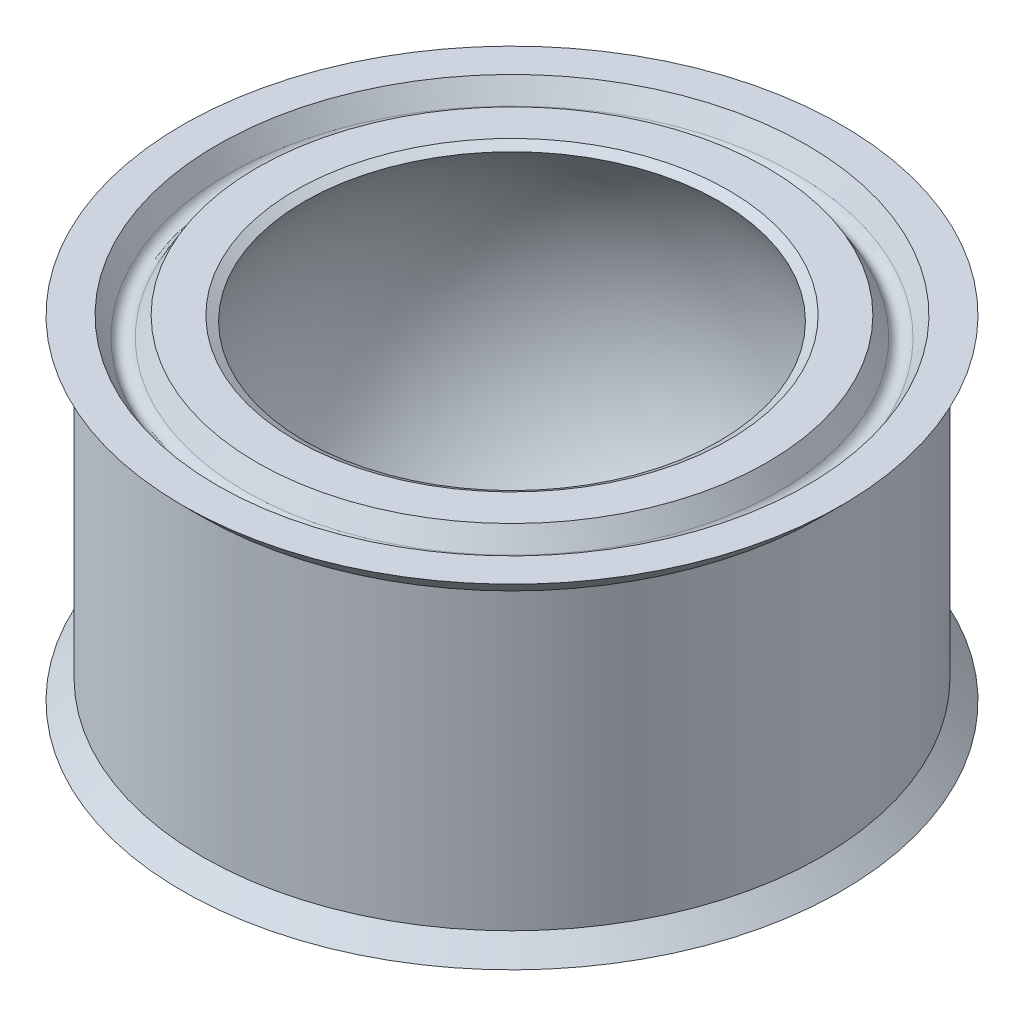
ISO-10303-21;
HEADER;
FILE_DESCRIPTION(('STEP AP214'),'2;1');
FILE_NAME('part.step','',(''),(''),'','','');
FILE_SCHEMA(('AUTOMOTIVE_DESIGN { 1 0 10303 214 1 1 1 1 }'));
ENDSEC;
DATA;
#1=APPLICATION_CONTEXT('core data for automotive mechanical design processes');
#2=APPLICATION_PROTOCOL_DEFINITION('international standard','automotive_design',2000,#1);
#3=PRODUCT_CONTEXT('',#1,'mechanical');
#4=PRODUCT('Part','Part','',(#3));
#5=PRODUCT_RELATED_PRODUCT_CATEGORY('part','',(#4));
#6=PRODUCT_DEFINITION_FORMATION('','',#4);
#7=PRODUCT_DEFINITION_CONTEXT('part definition',#1,'design');
#8=PRODUCT_DEFINITION('design','',#6,#7);
#9=PRODUCT_DEFINITION_SHAPE('','',#8);
#10=(LENGTH_UNIT() NAMED_UNIT(*) SI_UNIT(.MILLI.,.METRE.));
#11=(NAMED_UNIT(*) PLANE_ANGLE_UNIT() SI_UNIT($,.RADIAN.));
#12=(NAMED_UNIT(*) SI_UNIT($,.STERADIAN.) SOLID_ANGLE_UNIT());
#13=UNCERTAINTY_MEASURE_WITH_UNIT(LENGTH_MEASURE(1.E-05),#10,'distance_accuracy_value','');
#14=(GEOMETRIC_REPRESENTATION_CONTEXT(3) GLOBAL_UNCERTAINTY_ASSIGNED_CONTEXT((#13)) GLOBAL_UNIT_ASSIGNED_CONTEXT((#10,
#11,#12)) REPRESENTATION_CONTEXT('',''));
#15=CARTESIAN_POINT('',(0.,0.,0.));
#16=DIRECTION('',(0.,0.,1.));
#17=DIRECTION('',(1.,0.,0.));
#18=AXIS2_PLACEMENT_3D('',#15,#16,#17);
#19=CARTESIAN_POINT('',(0.,0.,39.6748));
#20=DIRECTION('',(0.,-1.,0.));
#21=DIRECTION('',(1.,0.,0.));
#22=AXIS2_PLACEMENT_3D('',#19,#20,#21);
#23=DEGENERATE_TOROIDAL_SURFACE('',#22,0.0076200000000071,6.73781301182615,.T.);
#24=CARTESIAN_POINT('',(0.,-4.14684588560021,39.6748));
#25=DIRECTION('',(0.,-1.,0.));
#26=DIRECTION('',(1.,0.,0.));
#27=AXIS2_PLACEMENT_3D('',#24,#25,#26);
#28=CIRCLE('',#27,5.31815607314457);
#29=CARTESIAN_POINT('',(-5.31815607312949,-4.14684588561096,39.6748));
#30=VERTEX_POINT('',#29);
#31=CARTESIAN_POINT('',(5.31815607312949,-4.14684588559675,39.6748));
#32=VERTEX_POINT('',#31);
#33=EDGE_CURVE('E46',#30,#32,#28,.T.);
#34=ORIENTED_EDGE('',*,*,#33,.T.);
#35=CARTESIAN_POINT('',(0.,-4.14684588560021,39.6748));
#36=DIRECTION('',(0.,-1.,0.));
#37=DIRECTION('',(1.,0.,0.));
#38=AXIS2_PLACEMENT_3D('',#35,#36,#37);
#39=CIRCLE('',#38,5.31815607314457);
#40=EDGE_CURVE('E42',#32,#30,#39,.T.);
#41=ORIENTED_EDGE('',*,*,#40,.T.);
#42=EDGE_LOOP('',(#34,#41));
#43=FACE_BOUND('',#42,.T.);
#44=CARTESIAN_POINT('',(0.,4.14684588560022,39.6748));
#45=DIRECTION('',(0.,1.,0.));
#46=DIRECTION('',(1.,0.,0.));
#47=AXIS2_PLACEMENT_3D('',#44,#45,#46);
#48=CIRCLE('',#47,5.31815607308772);
#49=CARTESIAN_POINT('',(5.31815607308772,4.14684588560021,39.6748));
#50=VERTEX_POINT('',#49);
#51=EDGE_CURVE('E56',#50,#50,#48,.T.);
#52=ORIENTED_EDGE('',*,*,#51,.T.);
#53=EDGE_LOOP('',(#52));
#54=FACE_BOUND('',#53,.T.);
#55=ADVANCED_FACE('F16',(#43,#54),#23,.F.);
#56=CARTESIAN_POINT('',(0.,-4.27989999991496,39.6748));
#57=DIRECTION('',(0.,-1.,0.));
#58=DIRECTION('',(1.,0.,0.));
#59=AXIS2_PLACEMENT_3D('',#56,#57,#58);
#60=CONICAL_SURFACE('',#59,5.54870547671271,1.04737208418554);
#61=CARTESIAN_POINT('',(0.,-4.27989999988215,39.6748));
#62=DIRECTION('',(0.,-1.,0.));
#63=DIRECTION('',(1.,0.,0.));
#64=AXIS2_PLACEMENT_3D('',#61,#62,#63);
#65=CIRCLE('',#64,5.54870547665587);
#66=CARTESIAN_POINT('',(-5.54870547665587,-4.27989999992698,39.6748));
#67=VERTEX_POINT('',#66);
#68=CARTESIAN_POINT('',(5.54870547659902,-4.27989999988215,39.6748));
#69=VERTEX_POINT('',#68);
#70=EDGE_CURVE('E19',#67,#69,#65,.F.);
#71=ORIENTED_EDGE('',*,*,#70,.F.);
#72=DIRECTION('',(0.866112657056276,0.49984884243831,0.));
#73=VECTOR('',#72,1.);
#74=CARTESIAN_POINT('',(-499000.,-287982.751096156,39.6748000000258));
#75=LINE('',#74,#73);
#76=EDGE_CURVE('E47',#67,#30,#75,.T.);
#77=ORIENTED_EDGE('',*,*,#76,.T.);
#78=ORIENTED_EDGE('',*,*,#40,.F.);
#79=DIRECTION('',(-0.866112657056275,0.49984884243831,0.));
#80=VECTOR('',#79,1.);
#81=CARTESIAN_POINT('',(499000.,-287982.751096157,39.6748));
#82=LINE('',#81,#80);
#83=EDGE_CURVE('E32',#32,#69,#82,.F.);
#84=ORIENTED_EDGE('',*,*,#83,.T.);
#85=EDGE_LOOP('',(#71,#77,#78,#84));
#86=FACE_BOUND('',#85,.T.);
#87=ADVANCED_FACE('F50',(#86),#60,.F.);
#88=CARTESIAN_POINT('',(0.,-4.2798999999718,39.6748));
#89=DIRECTION('',(0.,-1.,0.));
#90=DIRECTION('',(1.,0.,0.));
#91=AXIS2_PLACEMENT_3D('',#88,#89,#90);
#92=CONICAL_SURFACE('',#91,5.54870547676956,1.04737208410733);
#93=ORIENTED_EDGE('',*,*,#33,.F.);
#94=ORIENTED_EDGE('',*,*,#76,.F.);
#95=CARTESIAN_POINT('',(0.,-4.279899999939,39.6748));
#96=DIRECTION('',(0.,-1.,0.));
#97=DIRECTION('',(1.,0.,0.));
#98=AXIS2_PLACEMENT_3D('',#95,#96,#97);
#99=CIRCLE('',#98,5.54870547671271);
#100=EDGE_CURVE('E85',#69,#67,#99,.F.);
#101=ORIENTED_EDGE('',*,*,#100,.F.);
#102=ORIENTED_EDGE('',*,*,#83,.F.);
#103=EDGE_LOOP('',(#93,#94,#101,#102));
#104=FACE_BOUND('',#103,.T.);
#105=ADVANCED_FACE('F54',(#104),#92,.F.);
#106=CARTESIAN_POINT('',(0.,4.2798999999718,39.6748));
#107=DIRECTION('',(0.,1.,0.));
#108=DIRECTION('',(0.,0.,1.));
#109=AXIS2_PLACEMENT_3D('',#106,#107,#108);
#110=CONICAL_SURFACE('',#109,5.54870547676956,1.04737208421407);
#111=CARTESIAN_POINT('',(0.,4.2798999999718,39.6748));
#112=DIRECTION('',(0.,1.,0.));
#113=DIRECTION('',(0.,0.,1.));
#114=AXIS2_PLACEMENT_3D('',#111,#112,#113);
#115=CIRCLE('',#114,5.54870547676956);
#116=CARTESIAN_POINT('',(0.,4.2798999999718,45.2235054767696));
#117=VERTEX_POINT('',#116);
#118=EDGE_CURVE('E83',#117,#117,#115,.F.);
#119=ORIENTED_EDGE('',*,*,#118,.F.);
#120=EDGE_LOOP('',(#119));
#121=FACE_BOUND('',#120,.T.);
#122=ORIENTED_EDGE('',*,*,#51,.F.);
#123=EDGE_LOOP('',(#122));
#124=FACE_BOUND('',#123,.T.);
#125=ADVANCED_FACE('F127',(#121,#124),#110,.F.);
#126=CARTESIAN_POINT('',(0.,-4.2799,39.6748));
#127=DIRECTION('',(0.,-1.,0.));
#128=DIRECTION('',(0.,0.,-1.));
#129=AXIS2_PLACEMENT_3D('',#126,#127,#128);
#130=PLANE('',#129);
#131=CARTESIAN_POINT('',(0.,-4.27990000002865,39.6748));
#132=DIRECTION('',(0.,1.,0.));
#133=DIRECTION('',(0.,0.,1.));
#134=AXIS2_PLACEMENT_3D('',#131,#132,#133);
#135=CIRCLE('',#134,6.54049999999568);
#136=CARTESIAN_POINT('',(0.,-4.27990000002865,46.2152999999957));
#137=VERTEX_POINT('',#136);
#138=EDGE_CURVE('E80',#137,#137,#135,.T.);
#139=ORIENTED_EDGE('',*,*,#138,.F.);
#140=EDGE_LOOP('',(#139));
#141=FACE_BOUND('',#140,.T.);
#142=ORIENTED_EDGE('',*,*,#70,.T.);
#143=ORIENTED_EDGE('',*,*,#100,.T.);
#144=EDGE_LOOP('',(#142,#143));
#145=FACE_BOUND('',#144,.T.);
#146=ADVANCED_FACE('F123',(#141,#145),#130,.T.);
#147=CARTESIAN_POINT('',(0.,4.2799,39.6748));
#148=DIRECTION('',(0.,1.,0.));
#149=DIRECTION('',(0.,0.,1.));
#150=AXIS2_PLACEMENT_3D('',#147,#148,#149);
#151=PLANE('',#150);
#152=CARTESIAN_POINT('',(0.,4.27990000002865,39.6748));
#153=DIRECTION('',(0.,-1.,0.));
#154=DIRECTION('',(0.,0.,-1.));
#155=AXIS2_PLACEMENT_3D('',#152,#153,#154);
#156=CIRCLE('',#155,6.54049999999568);
#157=CARTESIAN_POINT('',(0.,4.27990000002865,33.1343000000043));
#158=VERTEX_POINT('',#157);
#159=EDGE_CURVE('E76',#158,#158,#156,.T.);
#160=ORIENTED_EDGE('',*,*,#159,.F.);
#161=EDGE_LOOP('',(#160));
#162=FACE_BOUND('',#161,.T.);
#163=ORIENTED_EDGE('',*,*,#118,.T.);
#164=EDGE_LOOP('',(#163));
#165=FACE_BOUND('',#164,.T.);
#166=ADVANCED_FACE('F119',(#162,#165),#151,.T.);
#167=CARTESIAN_POINT('',(0.,-3.7810188050571,39.6748));
#168=DIRECTION('',(0.,1.,0.));
#169=DIRECTION('',(0.,0.,1.));
#170=AXIS2_PLACEMENT_3D('',#167,#168,#169);
#171=CONICAL_SURFACE('',#170,6.82852919220546,0.523598775597274);
#172=CARTESIAN_POINT('',(0.,-3.78101880512248,39.6748));
#173=DIRECTION('',(0.,-1.,0.));
#174=DIRECTION('',(0.,0.,-1.));
#175=AXIS2_PLACEMENT_3D('',#172,#173,#174);
#176=CIRCLE('',#175,6.82852919215618);
#177=CARTESIAN_POINT('',(0.,-3.78101880512248,32.8462708078438));
#178=VERTEX_POINT('',#177);
#179=EDGE_CURVE('E79',#178,#178,#176,.T.);
#180=ORIENTED_EDGE('',*,*,#179,.T.);
#181=EDGE_LOOP('',(#180));
#182=FACE_BOUND('',#181,.T.);
#183=ORIENTED_EDGE('',*,*,#138,.T.);
#184=EDGE_LOOP('',(#183));
#185=FACE_BOUND('',#184,.T.);
#186=ADVANCED_FACE('F115',(#182,#185),#171,.T.);
#187=CARTESIAN_POINT('',(0.,3.7810188050571,39.6748));
#188=DIRECTION('',(0.,-1.,0.));
#189=DIRECTION('',(0.,0.,-1.));
#190=AXIS2_PLACEMENT_3D('',#187,#188,#189);
#191=CONICAL_SURFACE('',#190,6.82852919220546,0.523598775597275);
#192=CARTESIAN_POINT('',(0.,3.78101880512248,39.6748));
#193=DIRECTION('',(0.,1.,0.));
#194=DIRECTION('',(0.,0.,-1.));
#195=AXIS2_PLACEMENT_3D('',#192,#193,#194);
#196=CIRCLE('',#195,6.82852919215618);
#197=CARTESIAN_POINT('',(0.,3.78101880512248,32.8462708078438));
#198=VERTEX_POINT('',#197);
#199=EDGE_CURVE('E97',#198,#198,#196,.T.);
#200=ORIENTED_EDGE('',*,*,#199,.T.);
#201=EDGE_LOOP('',(#200));
#202=FACE_BOUND('',#201,.T.);
#203=ORIENTED_EDGE('',*,*,#159,.T.);
#204=EDGE_LOOP('',(#203));
#205=FACE_BOUND('',#204,.T.);
#206=ADVANCED_FACE('F110',(#202,#205),#191,.T.);
#207=CARTESIAN_POINT('',(0.,-3.90801901024499,39.6748));
#208=DIRECTION('',(0.,-1.,0.));
#209=DIRECTION('',(0.,0.,-1.));
#210=AXIS2_PLACEMENT_3D('',#207,#208,#209);
#211=TOROIDAL_SURFACE('',#210,7.0485,0.254000410244989);
#212=ORIENTED_EDGE('',*,*,#179,.F.);
#213=EDGE_LOOP('',(#212));
#214=FACE_BOUND('',#213,.T.);
#215=CARTESIAN_POINT('',(0.,-3.78101880512248,39.6748));
#216=DIRECTION('',(0.,-1.,0.));
#217=DIRECTION('',(0.,0.,1.));
#218=AXIS2_PLACEMENT_3D('',#215,#216,#217);
#219=CIRCLE('',#218,7.26847080784382);
#220=CARTESIAN_POINT('',(0.,-3.78101880512248,46.9432708078438));
#221=VERTEX_POINT('',#220);
#222=EDGE_CURVE('E100',#221,#221,#219,.T.);
#223=ORIENTED_EDGE('',*,*,#222,.T.);
#224=EDGE_LOOP('',(#223));
#225=FACE_BOUND('',#224,.T.);
#226=ADVANCED_FACE('F105',(#214,#225),#211,.F.);
#227=CARTESIAN_POINT('',(0.,3.90801901024499,39.6748));
#228=DIRECTION('',(0.,1.,0.));
#229=DIRECTION('',(0.,0.,-1.));
#230=AXIS2_PLACEMENT_3D('',#227,#228,#229);
#231=TOROIDAL_SURFACE('',#230,7.0485,0.254000410244989);
#232=ORIENTED_EDGE('',*,*,#199,.F.);
#233=EDGE_LOOP('',(#232));
#234=FACE_BOUND('',#233,.T.);
#235=CARTESIAN_POINT('',(0.,3.78101880512248,39.6748));
#236=DIRECTION('',(0.,1.,0.));
#237=DIRECTION('',(0.,0.,1.));
#238=AXIS2_PLACEMENT_3D('',#235,#236,#237);
#239=CIRCLE('',#238,7.26847080784382);
#240=CARTESIAN_POINT('',(0.,3.78101880512248,46.9432708078438));
#241=VERTEX_POINT('',#240);
#242=EDGE_CURVE('E75',#241,#241,#239,.T.);
#243=ORIENTED_EDGE('',*,*,#242,.T.);
#244=EDGE_LOOP('',(#243));
#245=FACE_BOUND('',#244,.T.);
#246=ADVANCED_FACE('F109',(#234,#245),#231,.F.);
#247=CARTESIAN_POINT('',(0.,-4.2799,39.6748));
#248=DIRECTION('',(0.,-1.,0.));
#249=DIRECTION('',(0.,0.,-1.));
#250=AXIS2_PLACEMENT_3D('',#247,#248,#249);
#251=CONICAL_SURFACE('',#250,7.55649999999999,0.523598775598298);
#252=CARTESIAN_POINT('',(0.,-4.2799,39.6748));
#253=DIRECTION('',(0.,-1.,0.));
#254=DIRECTION('',(0.,0.,-1.));
#255=AXIS2_PLACEMENT_3D('',#252,#253,#254);
#256=CIRCLE('',#255,7.55649999999999);
#257=CARTESIAN_POINT('',(0.,-4.2799,32.1183));
#258=VERTEX_POINT('',#257);
#259=EDGE_CURVE('E72',#258,#258,#256,.F.);
#260=ORIENTED_EDGE('',*,*,#259,.F.);
#261=EDGE_LOOP('',(#260));
#262=FACE_BOUND('',#261,.T.);
#263=ORIENTED_EDGE('',*,*,#222,.F.);
#264=EDGE_LOOP('',(#263));
#265=FACE_BOUND('',#264,.T.);
#266=ADVANCED_FACE('F167',(#262,#265),#251,.F.);
#267=CARTESIAN_POINT('',(0.,4.2799,39.6748));
#268=DIRECTION('',(0.,1.,0.));
#269=DIRECTION('',(0.,0.,1.));
#270=AXIS2_PLACEMENT_3D('',#267,#268,#269);
#271=CONICAL_SURFACE('',#270,7.55649999999999,0.523598775598298);
#272=CARTESIAN_POINT('',(0.,4.2799,39.6748));
#273=DIRECTION('',(0.,1.,0.));
#274=DIRECTION('',(0.,0.,1.));
#275=AXIS2_PLACEMENT_3D('',#272,#273,#274);
#276=CIRCLE('',#275,7.55649999999999);
#277=CARTESIAN_POINT('',(0.,4.2799,47.2313));
#278=VERTEX_POINT('',#277);
#279=EDGE_CURVE('E69',#278,#278,#276,.F.);
#280=ORIENTED_EDGE('',*,*,#279,.F.);
#281=EDGE_LOOP('',(#280));
#282=FACE_BOUND('',#281,.T.);
#283=ORIENTED_EDGE('',*,*,#242,.F.);
#284=EDGE_LOOP('',(#283));
#285=FACE_BOUND('',#284,.T.);
#286=ADVANCED_FACE('F164',(#282,#285),#271,.F.);
#287=CARTESIAN_POINT('',(0.,-4.2799,39.6748));
#288=DIRECTION('',(0.,-1.,0.));
#289=DIRECTION('',(0.,0.,-1.));
#290=AXIS2_PLACEMENT_3D('',#287,#288,#289);
#291=PLANE('',#290);
#292=ORIENTED_EDGE('',*,*,#259,.T.);
#293=EDGE_LOOP('',(#292));
#294=FACE_BOUND('',#293,.T.);
#295=CARTESIAN_POINT('',(0.,-4.2799,39.6748));
#296=DIRECTION('',(0.,-1.,0.));
#297=DIRECTION('',(0.,0.,-1.));
#298=AXIS2_PLACEMENT_3D('',#295,#296,#297);
#299=CIRCLE('',#298,8.4455);
#300=CARTESIAN_POINT('',(0.,-4.2799,31.2293));
#301=VERTEX_POINT('',#300);
#302=EDGE_CURVE('E66',#301,#301,#299,.F.);
#303=ORIENTED_EDGE('',*,*,#302,.F.);
#304=EDGE_LOOP('',(#303));
#305=FACE_BOUND('',#304,.T.);
#306=ADVANCED_FACE('F160',(#294,#305),#291,.T.);
#307=CARTESIAN_POINT('',(0.,4.2799,39.6748));
#308=DIRECTION('',(0.,1.,0.));
#309=DIRECTION('',(0.,0.,1.));
#310=AXIS2_PLACEMENT_3D('',#307,#308,#309);
#311=PLANE('',#310);
#312=ORIENTED_EDGE('',*,*,#279,.T.);
#313=EDGE_LOOP('',(#312));
#314=FACE_BOUND('',#313,.T.);
#315=CARTESIAN_POINT('',(0.,4.27990000000001,39.6748));
#316=DIRECTION('',(0.,1.,0.));
#317=DIRECTION('',(0.,0.,1.));
#318=AXIS2_PLACEMENT_3D('',#315,#316,#317);
#319=CIRCLE('',#318,8.4455);
#320=CARTESIAN_POINT('',(0.,4.2799,48.1203));
#321=VERTEX_POINT('',#320);
#322=EDGE_CURVE('E63',#321,#321,#319,.F.);
#323=ORIENTED_EDGE('',*,*,#322,.F.);
#324=EDGE_LOOP('',(#323));
#325=FACE_BOUND('',#324,.T.);
#326=ADVANCED_FACE('F156',(#314,#325),#311,.T.);
#327=CARTESIAN_POINT('',(0.,-4.2799,39.6748));
#328=DIRECTION('',(0.,-1.,0.));
#329=DIRECTION('',(0.,0.,-1.));
#330=AXIS2_PLACEMENT_3D('',#327,#328,#329);
#331=CONICAL_SURFACE('',#330,8.4455,0.785398163397451);
#332=CARTESIAN_POINT('',(0.,-3.7719,39.6748));
#333=DIRECTION('',(0.,1.,0.));
#334=DIRECTION('',(0.,0.,1.));
#335=AXIS2_PLACEMENT_3D('',#332,#333,#334);
#336=CIRCLE('',#335,7.9375);
#337=CARTESIAN_POINT('',(0.,-3.7719,47.6123));
#338=VERTEX_POINT('',#337);
#339=EDGE_CURVE('E25',#338,#338,#336,.T.);
#340=ORIENTED_EDGE('',*,*,#339,.F.);
#341=EDGE_LOOP('',(#340));
#342=FACE_BOUND('',#341,.T.);
#343=ORIENTED_EDGE('',*,*,#302,.T.);
#344=EDGE_LOOP('',(#343));
#345=FACE_BOUND('',#344,.T.);
#346=ADVANCED_FACE('F148',(#342,#345),#331,.T.);
#347=CARTESIAN_POINT('',(0.,4.2799,39.6748));
#348=DIRECTION('',(0.,1.,0.));
#349=DIRECTION('',(0.,0.,1.));
#350=AXIS2_PLACEMENT_3D('',#347,#348,#349);
#351=CONICAL_SURFACE('',#350,8.4455,0.785398163397448);
#352=ORIENTED_EDGE('',*,*,#322,.T.);
#353=EDGE_LOOP('',(#352));
#354=FACE_BOUND('',#353,.T.);
#355=CARTESIAN_POINT('',(0.,3.7719,39.6748));
#356=DIRECTION('',(0.,1.,0.));
#357=DIRECTION('',(0.,0.,1.));
#358=AXIS2_PLACEMENT_3D('',#355,#356,#357);
#359=CIRCLE('',#358,7.9375);
#360=CARTESIAN_POINT('',(0.,3.7719,47.6123));
#361=VERTEX_POINT('',#360);
#362=EDGE_CURVE('E11',#361,#361,#359,.F.);
#363=ORIENTED_EDGE('',*,*,#362,.F.);
#364=EDGE_LOOP('',(#363));
#365=FACE_BOUND('',#364,.T.);
#366=ADVANCED_FACE('F141',(#354,#365),#351,.T.);
#367=CARTESIAN_POINT('',(0.,0.,39.6748));
#368=DIRECTION('',(0.,1.,0.));
#369=DIRECTION('',(0.,0.,1.));
#370=AXIS2_PLACEMENT_3D('',#367,#368,#369);
#371=CYLINDRICAL_SURFACE('',#370,7.9375);
#372=ORIENTED_EDGE('',*,*,#339,.T.);
#373=EDGE_LOOP('',(#372));
#374=FACE_BOUND('',#373,.T.);
#375=ORIENTED_EDGE('',*,*,#362,.T.);
#376=EDGE_LOOP('',(#375));
#377=FACE_BOUND('',#376,.T.);
#378=ADVANCED_FACE('F139',(#374,#377),#371,.T.);
#379=CLOSED_SHELL('',(#55,#87,#105,#125,#146,#166,#186,#206,#226,#246,#266,#286,#306,#326,#346,
#366,#378));
#380=MANIFOLD_SOLID_BREP('B1',#379);
#381=ADVANCED_BREP_SHAPE_REPRESENTATION('',(#18,#380),#14);
#382=SHAPE_DEFINITION_REPRESENTATION(#9,#381);
ENDSEC;
END-ISO-10303-21;
